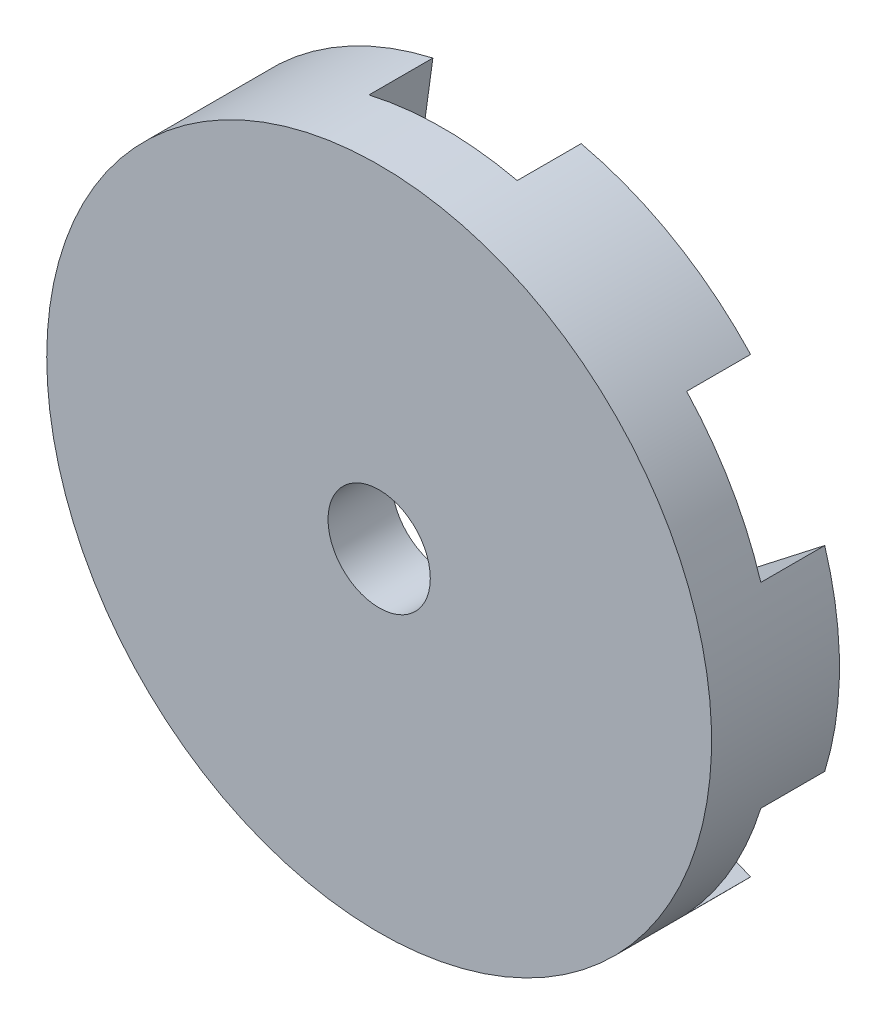
ISO-10303-21;
HEADER;
FILE_DESCRIPTION(('STEP AP214'),'2;1');
FILE_NAME('part.step','',(''),(''),'','','');
FILE_SCHEMA(('AUTOMOTIVE_DESIGN { 1 0 10303 214 1 1 1 1 }'));
ENDSEC;
DATA;
#1=APPLICATION_CONTEXT('core data for automotive mechanical design processes');
#2=APPLICATION_PROTOCOL_DEFINITION('international standard','automotive_design',2000,#1);
#3=PRODUCT_CONTEXT('',#1,'mechanical');
#4=PRODUCT('Part','Part','',(#3));
#5=PRODUCT_RELATED_PRODUCT_CATEGORY('part','',(#4));
#6=PRODUCT_DEFINITION_FORMATION('','',#4);
#7=PRODUCT_DEFINITION_CONTEXT('part definition',#1,'design');
#8=PRODUCT_DEFINITION('design','',#6,#7);
#9=PRODUCT_DEFINITION_SHAPE('','',#8);
#10=(LENGTH_UNIT() NAMED_UNIT(*) SI_UNIT(.MILLI.,.METRE.));
#11=(NAMED_UNIT(*) PLANE_ANGLE_UNIT() SI_UNIT($,.RADIAN.));
#12=(NAMED_UNIT(*) SI_UNIT($,.STERADIAN.) SOLID_ANGLE_UNIT());
#13=UNCERTAINTY_MEASURE_WITH_UNIT(LENGTH_MEASURE(1.E-05),#10,'distance_accuracy_value','');
#14=(GEOMETRIC_REPRESENTATION_CONTEXT(3) GLOBAL_UNCERTAINTY_ASSIGNED_CONTEXT((#13)) GLOBAL_UNIT_ASSIGNED_CONTEXT((#10,
#11,#12)) REPRESENTATION_CONTEXT('',''));
#15=CARTESIAN_POINT('',(0.,0.,0.));
#16=DIRECTION('',(0.,0.,1.));
#17=DIRECTION('',(1.,0.,0.));
#18=AXIS2_PLACEMENT_3D('',#15,#16,#17);
#19=CARTESIAN_POINT('',(0.,0.,0.));
#20=DIRECTION('',(0.,0.,1.));
#21=DIRECTION('',(1.,0.,0.));
#22=AXIS2_PLACEMENT_3D('',#19,#20,#21);
#23=CYLINDRICAL_SURFACE('',#22,2.);
#24=CARTESIAN_POINT('',(0.,0.,5.));
#25=DIRECTION('',(0.,0.,-1.));
#26=DIRECTION('',(-1.,0.,0.));
#27=AXIS2_PLACEMENT_3D('',#24,#25,#26);
#28=CIRCLE('',#27,2.);
#29=CARTESIAN_POINT('',(-2.,0.,5.));
#30=VERTEX_POINT('',#29);
#31=EDGE_CURVE('E253',#30,#30,#28,.F.);
#32=ORIENTED_EDGE('',*,*,#31,.T.);
#33=EDGE_LOOP('',(#32));
#34=FACE_BOUND('',#33,.T.);
#35=CARTESIAN_POINT('',(0.,0.,2.5));
#36=DIRECTION('',(0.,0.,1.));
#37=DIRECTION('',(1.,0.,0.));
#38=AXIS2_PLACEMENT_3D('',#35,#36,#37);
#39=CIRCLE('',#38,2.);
#40=CARTESIAN_POINT('',(2.,0.,2.5));
#41=VERTEX_POINT('',#40);
#42=EDGE_CURVE('E247',#41,#41,#39,.T.);
#43=ORIENTED_EDGE('',*,*,#42,.F.);
#44=EDGE_LOOP('',(#43));
#45=FACE_BOUND('',#44,.T.);
#46=ADVANCED_FACE('F32',(#34,#45),#23,.F.);
#47=CARTESIAN_POINT('',(0.,0.,5.));
#48=DIRECTION('',(0.,0.,-1.));
#49=DIRECTION('',(-1.,0.,0.));
#50=AXIS2_PLACEMENT_3D('',#47,#48,#49);
#51=CYLINDRICAL_SURFACE('',#50,13.);
#52=CARTESIAN_POINT('',(0.,0.,5.));
#53=DIRECTION('',(0.,0.,-1.));
#54=DIRECTION('',(-1.,0.,0.));
#55=AXIS2_PLACEMENT_3D('',#52,#53,#54);
#56=CIRCLE('',#55,13.);
#57=CARTESIAN_POINT('',(-13.,0.,5.));
#58=VERTEX_POINT('',#57);
#59=EDGE_CURVE('E325',#58,#58,#56,.T.);
#60=ORIENTED_EDGE('',*,*,#59,.T.);
#61=EDGE_LOOP('',(#60));
#62=FACE_BOUND('',#61,.T.);
#63=DIRECTION('',(0.,0.,-1.));
#64=VECTOR('',#63,1.);
#65=CARTESIAN_POINT('',(9.52526991334298,8.84699005752596,5.));
#66=LINE('',#65,#64);
#67=CARTESIAN_POINT('',(9.52526991334298,8.84699005752596,0.));
#68=VERTEX_POINT('',#67);
#69=CARTESIAN_POINT('',(9.52526991334298,8.84699005752596,2.5));
#70=VERTEX_POINT('',#69);
#71=EDGE_CURVE('E56',#68,#70,#66,.F.);
#72=ORIENTED_EDGE('',*,*,#71,.F.);
#73=CARTESIAN_POINT('',(0.,0.,0.));
#74=DIRECTION('',(0.,0.,1.));
#75=DIRECTION('',(1.,0.,0.));
#76=AXIS2_PLACEMENT_3D('',#73,#74,#75);
#77=CIRCLE('',#76,13.);
#78=CARTESIAN_POINT('',(2.89908318017435,12.6726207516216,0.));
#79=VERTEX_POINT('',#78);
#80=EDGE_CURVE('E212',#68,#79,#77,.T.);
#81=ORIENTED_EDGE('',*,*,#80,.T.);
#82=DIRECTION('',(0.,0.,-1.));
#83=VECTOR('',#82,1.);
#84=CARTESIAN_POINT('',(2.89908318017436,12.6726207516216,5.));
#85=LINE('',#84,#83);
#86=CARTESIAN_POINT('',(2.89908318017435,12.6726207516216,2.5));
#87=VERTEX_POINT('',#86);
#88=EDGE_CURVE('E205',#87,#79,#85,.T.);
#89=ORIENTED_EDGE('',*,*,#88,.F.);
#90=CARTESIAN_POINT('',(0.,0.,2.5));
#91=DIRECTION('',(0.,0.,1.));
#92=DIRECTION('',(1.,0.,0.));
#93=AXIS2_PLACEMENT_3D('',#90,#91,#92);
#94=CIRCLE('',#93,13.);
#95=CARTESIAN_POINT('',(-2.89908318017435,12.6726207516216,2.5));
#96=VERTEX_POINT('',#95);
#97=EDGE_CURVE('E41',#87,#96,#94,.T.);
#98=ORIENTED_EDGE('',*,*,#97,.T.);
#99=DIRECTION('',(0.,0.,-1.));
#100=VECTOR('',#99,1.);
#101=CARTESIAN_POINT('',(-2.89908318017436,12.6726207516216,5.));
#102=LINE('',#101,#100);
#103=CARTESIAN_POINT('',(-2.89908318017435,12.6726207516216,0.));
#104=VERTEX_POINT('',#103);
#105=EDGE_CURVE('E203',#104,#96,#102,.F.);
#106=ORIENTED_EDGE('',*,*,#105,.F.);
#107=CARTESIAN_POINT('',(-9.52526991334298,8.84699005752595,0.));
#108=VERTEX_POINT('',#107);
#109=EDGE_CURVE('E289',#104,#108,#77,.T.);
#110=ORIENTED_EDGE('',*,*,#109,.T.);
#111=DIRECTION('',(0.,0.,-1.));
#112=VECTOR('',#111,1.);
#113=CARTESIAN_POINT('',(-9.52526991334298,8.84699005752595,5.));
#114=LINE('',#113,#112);
#115=CARTESIAN_POINT('',(-9.52526991334298,8.84699005752595,2.5));
#116=VERTEX_POINT('',#115);
#117=EDGE_CURVE('E201',#116,#108,#114,.T.);
#118=ORIENTED_EDGE('',*,*,#117,.F.);
#119=CARTESIAN_POINT('',(-12.4243530935173,3.8256306940956,2.5));
#120=VERTEX_POINT('',#119);
#121=EDGE_CURVE('E233',#116,#120,#94,.T.);
#122=ORIENTED_EDGE('',*,*,#121,.T.);
#123=DIRECTION('',(0.,0.,-1.));
#124=VECTOR('',#123,1.);
#125=CARTESIAN_POINT('',(-12.4243530935173,3.8256306940956,5.));
#126=LINE('',#125,#124);
#127=CARTESIAN_POINT('',(-12.4243530935173,3.8256306940956,0.));
#128=VERTEX_POINT('',#127);
#129=EDGE_CURVE('E199',#128,#120,#126,.F.);
#130=ORIENTED_EDGE('',*,*,#129,.F.);
#131=CARTESIAN_POINT('',(-12.4243530935173,-3.82563069409565,0.));
#132=VERTEX_POINT('',#131);
#133=EDGE_CURVE('E288',#128,#132,#77,.T.);
#134=ORIENTED_EDGE('',*,*,#133,.T.);
#135=DIRECTION('',(0.,0.,-1.));
#136=VECTOR('',#135,1.);
#137=CARTESIAN_POINT('',(-12.4243530935173,-3.82563069409565,5.));
#138=LINE('',#137,#136);
#139=CARTESIAN_POINT('',(-12.4243530935173,-3.82563069409564,2.5));
#140=VERTEX_POINT('',#139);
#141=EDGE_CURVE('E197',#140,#132,#138,.T.);
#142=ORIENTED_EDGE('',*,*,#141,.F.);
#143=CARTESIAN_POINT('',(-9.52526991334295,-8.84699005752599,2.5));
#144=VERTEX_POINT('',#143);
#145=EDGE_CURVE('E229',#140,#144,#94,.T.);
#146=ORIENTED_EDGE('',*,*,#145,.T.);
#147=DIRECTION('',(0.,0.,-1.));
#148=VECTOR('',#147,1.);
#149=CARTESIAN_POINT('',(-9.52526991334295,-8.84699005752599,5.));
#150=LINE('',#149,#148);
#151=CARTESIAN_POINT('',(-9.52526991334295,-8.84699005752599,0.));
#152=VERTEX_POINT('',#151);
#153=EDGE_CURVE('E195',#152,#144,#150,.F.);
#154=ORIENTED_EDGE('',*,*,#153,.F.);
#155=CARTESIAN_POINT('',(-2.89908318017435,-12.6726207516216,0.));
#156=VERTEX_POINT('',#155);
#157=EDGE_CURVE('E290',#152,#156,#77,.T.);
#158=ORIENTED_EDGE('',*,*,#157,.T.);
#159=DIRECTION('',(0.,0.,-1.));
#160=VECTOR('',#159,1.);
#161=CARTESIAN_POINT('',(-2.89908318017435,-12.6726207516216,5.));
#162=LINE('',#161,#160);
#163=CARTESIAN_POINT('',(-2.89908318017435,-12.6726207516216,2.5));
#164=VERTEX_POINT('',#163);
#165=EDGE_CURVE('E193',#164,#156,#162,.T.);
#166=ORIENTED_EDGE('',*,*,#165,.F.);
#167=CARTESIAN_POINT('',(2.89908318017437,-12.6726207516216,2.5));
#168=VERTEX_POINT('',#167);
#169=EDGE_CURVE('E224',#164,#168,#94,.T.);
#170=ORIENTED_EDGE('',*,*,#169,.T.);
#171=DIRECTION('',(0.,0.,-1.));
#172=VECTOR('',#171,1.);
#173=CARTESIAN_POINT('',(2.89908318017437,-12.6726207516216,5.));
#174=LINE('',#173,#172);
#175=CARTESIAN_POINT('',(2.89908318017437,-12.6726207516216,0.));
#176=VERTEX_POINT('',#175);
#177=EDGE_CURVE('E191',#176,#168,#174,.F.);
#178=ORIENTED_EDGE('',*,*,#177,.F.);
#179=CARTESIAN_POINT('',(9.52526991334296,-8.84699005752598,0.));
#180=VERTEX_POINT('',#179);
#181=EDGE_CURVE('E211',#176,#180,#77,.T.);
#182=ORIENTED_EDGE('',*,*,#181,.T.);
#183=DIRECTION('',(0.,0.,-1.));
#184=VECTOR('',#183,1.);
#185=CARTESIAN_POINT('',(9.52526991334296,-8.84699005752598,5.));
#186=LINE('',#185,#184);
#187=CARTESIAN_POINT('',(9.52526991334296,-8.84699005752598,2.5));
#188=VERTEX_POINT('',#187);
#189=EDGE_CURVE('E189',#188,#180,#186,.T.);
#190=ORIENTED_EDGE('',*,*,#189,.F.);
#191=CARTESIAN_POINT('',(12.4243530935173,-3.82563069409563,2.5));
#192=VERTEX_POINT('',#191);
#193=EDGE_CURVE('E36',#188,#192,#94,.T.);
#194=ORIENTED_EDGE('',*,*,#193,.T.);
#195=DIRECTION('',(0.,0.,-1.));
#196=VECTOR('',#195,1.);
#197=CARTESIAN_POINT('',(12.4243530935173,-3.82563069409563,5.));
#198=LINE('',#197,#196);
#199=CARTESIAN_POINT('',(12.4243530935173,-3.82563069409563,0.));
#200=VERTEX_POINT('',#199);
#201=EDGE_CURVE('E182',#200,#192,#198,.F.);
#202=ORIENTED_EDGE('',*,*,#201,.F.);
#203=CARTESIAN_POINT('',(12.4243530935173,3.82563069409561,0.));
#204=VERTEX_POINT('',#203);
#205=EDGE_CURVE('E208',#200,#204,#77,.T.);
#206=ORIENTED_EDGE('',*,*,#205,.T.);
#207=DIRECTION('',(0.,0.,-1.));
#208=VECTOR('',#207,1.);
#209=CARTESIAN_POINT('',(12.4243530935173,3.82563069409561,5.));
#210=LINE('',#209,#208);
#211=CARTESIAN_POINT('',(12.4243530935173,3.82563069409561,2.5));
#212=VERTEX_POINT('',#211);
#213=EDGE_CURVE('E48',#212,#204,#210,.T.);
#214=ORIENTED_EDGE('',*,*,#213,.F.);
#215=EDGE_CURVE('E11',#212,#70,#94,.T.);
#216=ORIENTED_EDGE('',*,*,#215,.T.);
#217=EDGE_LOOP('',(#72,#81,#89,#98,#106,#110,#118,#122,#130,#134,#142,#146,#154,#158,#166,#170,
#178,#182,#190,#194,#202,#206,#214,#216));
#218=FACE_BOUND('',#217,.T.);
#219=ADVANCED_FACE('F34',(#62,#218),#51,.T.);
#220=CARTESIAN_POINT('',(0.,0.,0.));
#221=DIRECTION('',(0.,0.,1.));
#222=DIRECTION('',(1.,0.,0.));
#223=AXIS2_PLACEMENT_3D('',#220,#221,#222);
#224=PLANE('',#223);
#225=DIRECTION('',(0.926153324129743,0.37714721290688,0.));
#226=VECTOR('',#225,1.);
#227=CARTESIAN_POINT('',(-1.73534493632216,4.26145395295102,0.));
#228=LINE('',#227,#226);
#229=CARTESIAN_POINT('',(3.75,6.49519052838327,0.));
#230=VERTEX_POINT('',#229);
#231=EDGE_CURVE('E222',#230,#68,#228,.T.);
#232=ORIENTED_EDGE('',*,*,#231,.F.);
#233=DIRECTION('',(-0.136457594721015,0.990645912949201,0.));
#234=VECTOR('',#233,1.);
#235=CARTESIAN_POINT('',(3.75,6.49519052838327,0.));
#236=LINE('',#235,#234);
#237=EDGE_CURVE('E179',#230,#79,#236,.T.);
#238=ORIENTED_EDGE('',*,*,#237,.T.);
#239=ORIENTED_EDGE('',*,*,#80,.F.);
#240=EDGE_LOOP('',(#232,#238,#239));
#241=FACE_BOUND('',#240,.T.);
#242=ADVANCED_FACE('F245',(#241),#224,.F.);
#243=DIRECTION('',(0.136457594721015,0.990645912949201,0.));
#244=VECTOR('',#243,1.);
#245=CARTESIAN_POINT('',(-4.55819984847429,0.627874177291836,0.));
#246=LINE('',#245,#244);
#247=CARTESIAN_POINT('',(-3.75,6.49519052838327,0.));
#248=VERTEX_POINT('',#247);
#249=EDGE_CURVE('E221',#248,#104,#246,.T.);
#250=ORIENTED_EDGE('',*,*,#249,.F.);
#251=DIRECTION('',(-0.926153324129744,0.377147212906878,0.));
#252=VECTOR('',#251,1.);
#253=CARTESIAN_POINT('',(-3.75,6.49519052838327,0.));
#254=LINE('',#253,#252);
#255=EDGE_CURVE('E246',#248,#108,#254,.T.);
#256=ORIENTED_EDGE('',*,*,#255,.T.);
#257=ORIENTED_EDGE('',*,*,#109,.F.);
#258=EDGE_LOOP('',(#250,#256,#257));
#259=FACE_BOUND('',#258,.T.);
#260=ADVANCED_FACE('F386',(#259),#224,.F.);
#261=DIRECTION('',(-0.789695729408728,0.61349870004232,0.));
#262=VECTOR('',#261,1.);
#263=CARTESIAN_POINT('',(-2.82285491215214,-3.63357977565922,0.));
#264=LINE('',#263,#262);
#265=CARTESIAN_POINT('',(-7.5,0.,0.));
#266=VERTEX_POINT('',#265);
#267=EDGE_CURVE('E219',#266,#128,#264,.T.);
#268=ORIENTED_EDGE('',*,*,#267,.F.);
#269=DIRECTION('',(-0.789695729408727,-0.613498700042321,0.));
#270=VECTOR('',#269,1.);
#271=CARTESIAN_POINT('',(-7.5,0.,0.));
#272=LINE('',#271,#270);
#273=EDGE_CURVE('E250',#266,#132,#272,.T.);
#274=ORIENTED_EDGE('',*,*,#273,.T.);
#275=ORIENTED_EDGE('',*,*,#133,.F.);
#276=EDGE_LOOP('',(#268,#274,#275));
#277=FACE_BOUND('',#276,.T.);
#278=ADVANCED_FACE('F287',(#277),#224,.F.);
#279=DIRECTION('',(-0.926153324129743,-0.37714721290688,0.));
#280=VECTOR('',#279,1.);
#281=CARTESIAN_POINT('',(1.73534493632217,-4.26145395295105,0.));
#282=LINE('',#281,#280);
#283=CARTESIAN_POINT('',(-3.75,-6.49519052838331,0.));
#284=VERTEX_POINT('',#283);
#285=EDGE_CURVE('E217',#284,#152,#282,.T.);
#286=ORIENTED_EDGE('',*,*,#285,.F.);
#287=DIRECTION('',(0.136457594721016,-0.9906459129492,0.));
#288=VECTOR('',#287,1.);
#289=CARTESIAN_POINT('',(-3.75,-6.49519052838331,0.));
#290=LINE('',#289,#288);
#291=EDGE_CURVE('E261',#284,#156,#290,.T.);
#292=ORIENTED_EDGE('',*,*,#291,.T.);
#293=ORIENTED_EDGE('',*,*,#157,.F.);
#294=EDGE_LOOP('',(#286,#292,#293));
#295=FACE_BOUND('',#294,.T.);
#296=ADVANCED_FACE('F471',(#295),#224,.F.);
#297=DIRECTION('',(-0.136457594721015,-0.990645912949201,0.));
#298=VECTOR('',#297,1.);
#299=CARTESIAN_POINT('',(4.5581998484743,-0.627874177291836,0.));
#300=LINE('',#299,#298);
#301=CARTESIAN_POINT('',(3.75,-6.49519052838331,0.));
#302=VERTEX_POINT('',#301);
#303=EDGE_CURVE('E215',#302,#176,#300,.T.);
#304=ORIENTED_EDGE('',*,*,#303,.F.);
#305=DIRECTION('',(0.926153324129743,-0.377147212906879,0.));
#306=VECTOR('',#305,1.);
#307=CARTESIAN_POINT('',(3.75,-6.49519052838331,0.));
#308=LINE('',#307,#306);
#309=EDGE_CURVE('E264',#302,#180,#308,.T.);
#310=ORIENTED_EDGE('',*,*,#309,.T.);
#311=ORIENTED_EDGE('',*,*,#181,.F.);
#312=EDGE_LOOP('',(#304,#310,#311));
#313=FACE_BOUND('',#312,.T.);
#314=ADVANCED_FACE('F297',(#313),#224,.F.);
#315=DIRECTION('',(0.789695729408728,-0.613498700042321,0.));
#316=VECTOR('',#315,1.);
#317=CARTESIAN_POINT('',(2.82285491215212,3.63357977565919,0.));
#318=LINE('',#317,#316);
#319=CARTESIAN_POINT('',(7.5,0.,0.));
#320=VERTEX_POINT('',#319);
#321=EDGE_CURVE('E213',#320,#200,#318,.T.);
#322=ORIENTED_EDGE('',*,*,#321,.F.);
#323=DIRECTION('',(0.789695729408728,0.613498700042321,0.));
#324=VECTOR('',#323,1.);
#325=CARTESIAN_POINT('',(7.5,0.,0.));
#326=LINE('',#325,#324);
#327=EDGE_CURVE('E166',#320,#204,#326,.T.);
#328=ORIENTED_EDGE('',*,*,#327,.T.);
#329=ORIENTED_EDGE('',*,*,#205,.F.);
#330=EDGE_LOOP('',(#322,#328,#329));
#331=FACE_BOUND('',#330,.T.);
#332=ADVANCED_FACE('F343',(#331),#224,.F.);
#333=CARTESIAN_POINT('',(11.4315353299546,6.6,2.5));
#334=DIRECTION('',(0.,0.,1.));
#335=DIRECTION('',(1.,0.,0.));
#336=AXIS2_PLACEMENT_3D('',#333,#334,#335);
#337=PLANE('',#336);
#338=ORIENTED_EDGE('',*,*,#42,.T.);
#339=EDGE_LOOP('',(#338));
#340=FACE_BOUND('',#339,.T.);
#341=DIRECTION('',(0.789695729408728,0.613498700042321,0.));
#342=VECTOR('',#341,1.);
#343=CARTESIAN_POINT('',(7.5,0.,2.5));
#344=LINE('',#343,#342);
#345=CARTESIAN_POINT('',(7.5,0.,2.5));
#346=VERTEX_POINT('',#345);
#347=EDGE_CURVE('E256',#346,#212,#344,.T.);
#348=ORIENTED_EDGE('',*,*,#347,.F.);
#349=DIRECTION('',(-0.789695729408728,0.613498700042321,0.));
#350=VECTOR('',#349,1.);
#351=CARTESIAN_POINT('',(7.5,0.,2.5));
#352=LINE('',#351,#350);
#353=EDGE_CURVE('E306',#192,#346,#352,.T.);
#354=ORIENTED_EDGE('',*,*,#353,.F.);
#355=ORIENTED_EDGE('',*,*,#193,.F.);
#356=DIRECTION('',(0.926153324129743,-0.377147212906879,0.));
#357=VECTOR('',#356,1.);
#358=CARTESIAN_POINT('',(3.75,-6.49519052838331,2.5));
#359=LINE('',#358,#357);
#360=CARTESIAN_POINT('',(3.75,-6.49519052838331,2.5));
#361=VERTEX_POINT('',#360);
#362=EDGE_CURVE('E304',#361,#188,#359,.T.);
#363=ORIENTED_EDGE('',*,*,#362,.F.);
#364=DIRECTION('',(0.136457594721015,0.990645912949201,0.));
#365=VECTOR('',#364,1.);
#366=CARTESIAN_POINT('',(3.75,-6.49519052838331,2.5));
#367=LINE('',#366,#365);
#368=EDGE_CURVE('E307',#168,#361,#367,.T.);
#369=ORIENTED_EDGE('',*,*,#368,.F.);
#370=ORIENTED_EDGE('',*,*,#169,.F.);
#371=DIRECTION('',(0.136457594721016,-0.9906459129492,0.));
#372=VECTOR('',#371,1.);
#373=CARTESIAN_POINT('',(-3.75,-6.49519052838331,2.5));
#374=LINE('',#373,#372);
#375=CARTESIAN_POINT('',(-3.75,-6.49519052838331,2.5));
#376=VERTEX_POINT('',#375);
#377=EDGE_CURVE('E309',#376,#164,#374,.T.);
#378=ORIENTED_EDGE('',*,*,#377,.F.);
#379=DIRECTION('',(0.926153324129743,0.37714721290688,0.));
#380=VECTOR('',#379,1.);
#381=CARTESIAN_POINT('',(-3.75,-6.49519052838331,2.5));
#382=LINE('',#381,#380);
#383=EDGE_CURVE('E314',#144,#376,#382,.T.);
#384=ORIENTED_EDGE('',*,*,#383,.F.);
#385=ORIENTED_EDGE('',*,*,#145,.F.);
#386=DIRECTION('',(-0.789695729408727,-0.613498700042321,0.));
#387=VECTOR('',#386,1.);
#388=CARTESIAN_POINT('',(-7.5,0.,2.5));
#389=LINE('',#388,#387);
#390=CARTESIAN_POINT('',(-7.5,0.,2.5));
#391=VERTEX_POINT('',#390);
#392=EDGE_CURVE('E316',#391,#140,#389,.T.);
#393=ORIENTED_EDGE('',*,*,#392,.F.);
#394=DIRECTION('',(0.789695729408728,-0.61349870004232,0.));
#395=VECTOR('',#394,1.);
#396=CARTESIAN_POINT('',(-7.5,0.,2.5));
#397=LINE('',#396,#395);
#398=EDGE_CURVE('E279',#120,#391,#397,.T.);
#399=ORIENTED_EDGE('',*,*,#398,.F.);
#400=ORIENTED_EDGE('',*,*,#121,.F.);
#401=DIRECTION('',(-0.926153324129744,0.377147212906878,0.));
#402=VECTOR('',#401,1.);
#403=CARTESIAN_POINT('',(-3.75,6.49519052838327,2.5));
#404=LINE('',#403,#402);
#405=CARTESIAN_POINT('',(-3.75,6.49519052838327,2.5));
#406=VERTEX_POINT('',#405);
#407=EDGE_CURVE('E319',#406,#116,#404,.T.);
#408=ORIENTED_EDGE('',*,*,#407,.F.);
#409=DIRECTION('',(-0.136457594721015,-0.990645912949201,0.));
#410=VECTOR('',#409,1.);
#411=CARTESIAN_POINT('',(-3.75,6.49519052838327,2.5));
#412=LINE('',#411,#410);
#413=EDGE_CURVE('E175',#96,#406,#412,.T.);
#414=ORIENTED_EDGE('',*,*,#413,.F.);
#415=ORIENTED_EDGE('',*,*,#97,.F.);
#416=DIRECTION('',(-0.136457594721015,0.990645912949201,0.));
#417=VECTOR('',#416,1.);
#418=CARTESIAN_POINT('',(3.75,6.49519052838327,2.5));
#419=LINE('',#418,#417);
#420=CARTESIAN_POINT('',(3.75,6.49519052838327,2.5));
#421=VERTEX_POINT('',#420);
#422=EDGE_CURVE('E165',#421,#87,#419,.T.);
#423=ORIENTED_EDGE('',*,*,#422,.F.);
#424=DIRECTION('',(-0.926153324129743,-0.37714721290688,0.));
#425=VECTOR('',#424,1.);
#426=CARTESIAN_POINT('',(3.75,6.49519052838327,2.5));
#427=LINE('',#426,#425);
#428=EDGE_CURVE('E158',#70,#421,#427,.T.);
#429=ORIENTED_EDGE('',*,*,#428,.F.);
#430=ORIENTED_EDGE('',*,*,#215,.F.);
#431=EDGE_LOOP('',(#348,#354,#355,#363,#369,#370,#378,#384,#385,#393,#399,#400,#408,#414,#415,
#423,#429,#430));
#432=FACE_BOUND('',#431,.T.);
#433=ADVANCED_FACE('F170',(#340,#432),#337,.F.);
#434=CARTESIAN_POINT('',(3.75,6.49519052838327,2.5));
#435=DIRECTION('',(0.37714721290688,-0.926153324129743,0.));
#436=DIRECTION('',(0.926153324129743,0.37714721290688,0.));
#437=AXIS2_PLACEMENT_3D('',#434,#435,#436);
#438=PLANE('',#437);
#439=ORIENTED_EDGE('',*,*,#71,.T.);
#440=ORIENTED_EDGE('',*,*,#428,.T.);
#441=DIRECTION('',(0.,0.,-1.));
#442=VECTOR('',#441,1.);
#443=CARTESIAN_POINT('',(3.75,6.49519052838327,2.5));
#444=LINE('',#443,#442);
#445=EDGE_CURVE('E162',#421,#230,#444,.T.);
#446=ORIENTED_EDGE('',*,*,#445,.T.);
#447=ORIENTED_EDGE('',*,*,#231,.T.);
#448=EDGE_LOOP('',(#439,#440,#446,#447));
#449=FACE_BOUND('',#448,.T.);
#450=ADVANCED_FACE('F160',(#449),#438,.T.);
#451=CARTESIAN_POINT('',(3.75,6.49519052838327,2.5));
#452=DIRECTION('',(-0.990645912949201,-0.136457594721015,0.));
#453=DIRECTION('',(0.136457594721015,-0.990645912949201,0.));
#454=AXIS2_PLACEMENT_3D('',#451,#452,#453);
#455=PLANE('',#454);
#456=ORIENTED_EDGE('',*,*,#88,.T.);
#457=ORIENTED_EDGE('',*,*,#237,.F.);
#458=ORIENTED_EDGE('',*,*,#445,.F.);
#459=ORIENTED_EDGE('',*,*,#422,.T.);
#460=EDGE_LOOP('',(#456,#457,#458,#459));
#461=FACE_BOUND('',#460,.T.);
#462=ADVANCED_FACE('F177',(#461),#455,.T.);
#463=CARTESIAN_POINT('',(-3.75,6.49519052838327,2.5));
#464=DIRECTION('',(0.990645912949201,-0.136457594721015,0.));
#465=DIRECTION('',(0.136457594721015,0.990645912949201,0.));
#466=AXIS2_PLACEMENT_3D('',#463,#464,#465);
#467=PLANE('',#466);
#468=ORIENTED_EDGE('',*,*,#105,.T.);
#469=ORIENTED_EDGE('',*,*,#413,.T.);
#470=DIRECTION('',(0.,0.,-1.));
#471=VECTOR('',#470,1.);
#472=CARTESIAN_POINT('',(-3.75,6.49519052838327,2.5));
#473=LINE('',#472,#471);
#474=EDGE_CURVE('E180',#406,#248,#473,.T.);
#475=ORIENTED_EDGE('',*,*,#474,.T.);
#476=ORIENTED_EDGE('',*,*,#249,.T.);
#477=EDGE_LOOP('',(#468,#469,#475,#476));
#478=FACE_BOUND('',#477,.T.);
#479=ADVANCED_FACE('F379',(#478),#467,.T.);
#480=CARTESIAN_POINT('',(-3.75,6.49519052838327,2.5));
#481=DIRECTION('',(-0.377147212906878,-0.926153324129744,0.));
#482=DIRECTION('',(0.926153324129744,-0.377147212906878,0.));
#483=AXIS2_PLACEMENT_3D('',#480,#481,#482);
#484=PLANE('',#483);
#485=ORIENTED_EDGE('',*,*,#117,.T.);
#486=ORIENTED_EDGE('',*,*,#255,.F.);
#487=ORIENTED_EDGE('',*,*,#474,.F.);
#488=ORIENTED_EDGE('',*,*,#407,.T.);
#489=EDGE_LOOP('',(#485,#486,#487,#488));
#490=FACE_BOUND('',#489,.T.);
#491=ADVANCED_FACE('F376',(#490),#484,.T.);
#492=CARTESIAN_POINT('',(-7.5,0.,2.5));
#493=DIRECTION('',(0.61349870004232,0.789695729408728,0.));
#494=DIRECTION('',(-0.789695729408728,0.61349870004232,0.));
#495=AXIS2_PLACEMENT_3D('',#492,#493,#494);
#496=PLANE('',#495);
#497=ORIENTED_EDGE('',*,*,#129,.T.);
#498=ORIENTED_EDGE('',*,*,#398,.T.);
#499=DIRECTION('',(0.,0.,-1.));
#500=VECTOR('',#499,1.);
#501=CARTESIAN_POINT('',(-7.5,0.,2.5));
#502=LINE('',#501,#500);
#503=EDGE_CURVE('E184',#391,#266,#502,.T.);
#504=ORIENTED_EDGE('',*,*,#503,.T.);
#505=ORIENTED_EDGE('',*,*,#267,.T.);
#506=EDGE_LOOP('',(#497,#498,#504,#505));
#507=FACE_BOUND('',#506,.T.);
#508=ADVANCED_FACE('F276',(#507),#496,.T.);
#509=CARTESIAN_POINT('',(-7.5,0.,2.5));
#510=DIRECTION('',(0.613498700042321,-0.789695729408727,0.));
#511=DIRECTION('',(0.789695729408727,0.613498700042321,0.));
#512=AXIS2_PLACEMENT_3D('',#509,#510,#511);
#513=PLANE('',#512);
#514=ORIENTED_EDGE('',*,*,#141,.T.);
#515=ORIENTED_EDGE('',*,*,#273,.F.);
#516=ORIENTED_EDGE('',*,*,#503,.F.);
#517=ORIENTED_EDGE('',*,*,#392,.T.);
#518=EDGE_LOOP('',(#514,#515,#516,#517));
#519=FACE_BOUND('',#518,.T.);
#520=ADVANCED_FACE('F283',(#519),#513,.T.);
#521=CARTESIAN_POINT('',(-3.75,-6.49519052838331,2.5));
#522=DIRECTION('',(-0.37714721290688,0.926153324129743,0.));
#523=DIRECTION('',(-0.926153324129743,-0.37714721290688,0.));
#524=AXIS2_PLACEMENT_3D('',#521,#522,#523);
#525=PLANE('',#524);
#526=ORIENTED_EDGE('',*,*,#153,.T.);
#527=ORIENTED_EDGE('',*,*,#383,.T.);
#528=DIRECTION('',(0.,0.,-1.));
#529=VECTOR('',#528,1.);
#530=CARTESIAN_POINT('',(-3.75,-6.49519052838331,2.5));
#531=LINE('',#530,#529);
#532=EDGE_CURVE('E272',#376,#284,#531,.T.);
#533=ORIENTED_EDGE('',*,*,#532,.T.);
#534=ORIENTED_EDGE('',*,*,#285,.T.);
#535=EDGE_LOOP('',(#526,#527,#533,#534));
#536=FACE_BOUND('',#535,.T.);
#537=ADVANCED_FACE('F367',(#536),#525,.T.);
#538=CARTESIAN_POINT('',(-3.75,-6.49519052838331,2.5));
#539=DIRECTION('',(0.9906459129492,0.136457594721016,0.));
#540=DIRECTION('',(-0.136457594721016,0.990645912949201,0.));
#541=AXIS2_PLACEMENT_3D('',#538,#539,#540);
#542=PLANE('',#541);
#543=ORIENTED_EDGE('',*,*,#165,.T.);
#544=ORIENTED_EDGE('',*,*,#291,.F.);
#545=ORIENTED_EDGE('',*,*,#532,.F.);
#546=ORIENTED_EDGE('',*,*,#377,.T.);
#547=EDGE_LOOP('',(#543,#544,#545,#546));
#548=FACE_BOUND('',#547,.T.);
#549=ADVANCED_FACE('F363',(#548),#542,.T.);
#550=CARTESIAN_POINT('',(3.75,-6.49519052838331,2.5));
#551=DIRECTION('',(-0.990645912949201,0.136457594721015,0.));
#552=DIRECTION('',(-0.136457594721015,-0.990645912949201,0.));
#553=AXIS2_PLACEMENT_3D('',#550,#551,#552);
#554=PLANE('',#553);
#555=ORIENTED_EDGE('',*,*,#177,.T.);
#556=ORIENTED_EDGE('',*,*,#368,.T.);
#557=DIRECTION('',(0.,0.,-1.));
#558=VECTOR('',#557,1.);
#559=CARTESIAN_POINT('',(3.75,-6.49519052838331,2.5));
#560=LINE('',#559,#558);
#561=EDGE_CURVE('E270',#361,#302,#560,.T.);
#562=ORIENTED_EDGE('',*,*,#561,.T.);
#563=ORIENTED_EDGE('',*,*,#303,.T.);
#564=EDGE_LOOP('',(#555,#556,#562,#563));
#565=FACE_BOUND('',#564,.T.);
#566=ADVANCED_FACE('F360',(#565),#554,.T.);
#567=CARTESIAN_POINT('',(3.75,-6.49519052838331,2.5));
#568=DIRECTION('',(0.377147212906879,0.926153324129743,0.));
#569=DIRECTION('',(-0.926153324129743,0.377147212906879,0.));
#570=AXIS2_PLACEMENT_3D('',#567,#568,#569);
#571=PLANE('',#570);
#572=ORIENTED_EDGE('',*,*,#189,.T.);
#573=ORIENTED_EDGE('',*,*,#309,.F.);
#574=ORIENTED_EDGE('',*,*,#561,.F.);
#575=ORIENTED_EDGE('',*,*,#362,.T.);
#576=EDGE_LOOP('',(#572,#573,#574,#575));
#577=FACE_BOUND('',#576,.T.);
#578=ADVANCED_FACE('F301',(#577),#571,.T.);
#579=CARTESIAN_POINT('',(7.5,0.,2.5));
#580=DIRECTION('',(-0.613498700042321,-0.789695729408728,0.));
#581=DIRECTION('',(0.789695729408728,-0.613498700042321,0.));
#582=AXIS2_PLACEMENT_3D('',#579,#580,#581);
#583=PLANE('',#582);
#584=ORIENTED_EDGE('',*,*,#201,.T.);
#585=ORIENTED_EDGE('',*,*,#353,.T.);
#586=DIRECTION('',(0.,0.,-1.));
#587=VECTOR('',#586,1.);
#588=CARTESIAN_POINT('',(7.5,0.,2.5));
#589=LINE('',#588,#587);
#590=EDGE_CURVE('E268',#346,#320,#589,.T.);
#591=ORIENTED_EDGE('',*,*,#590,.T.);
#592=ORIENTED_EDGE('',*,*,#321,.T.);
#593=EDGE_LOOP('',(#584,#585,#591,#592));
#594=FACE_BOUND('',#593,.T.);
#595=ADVANCED_FACE('F354',(#594),#583,.T.);
#596=CARTESIAN_POINT('',(7.5,0.,2.5));
#597=DIRECTION('',(-0.613498700042321,0.789695729408728,0.));
#598=DIRECTION('',(-0.789695729408728,-0.613498700042321,0.));
#599=AXIS2_PLACEMENT_3D('',#596,#597,#598);
#600=PLANE('',#599);
#601=ORIENTED_EDGE('',*,*,#213,.T.);
#602=ORIENTED_EDGE('',*,*,#327,.F.);
#603=ORIENTED_EDGE('',*,*,#590,.F.);
#604=ORIENTED_EDGE('',*,*,#347,.T.);
#605=EDGE_LOOP('',(#601,#602,#603,#604));
#606=FACE_BOUND('',#605,.T.);
#607=ADVANCED_FACE('F333',(#606),#600,.T.);
#608=CARTESIAN_POINT('',(0.,0.,5.));
#609=DIRECTION('',(0.,0.,-1.));
#610=DIRECTION('',(-1.,0.,0.));
#611=AXIS2_PLACEMENT_3D('',#608,#609,#610);
#612=PLANE('',#611);
#613=ORIENTED_EDGE('',*,*,#59,.F.);
#614=EDGE_LOOP('',(#613));
#615=FACE_BOUND('',#614,.T.);
#616=ORIENTED_EDGE('',*,*,#31,.F.);
#617=EDGE_LOOP('',(#616));
#618=FACE_BOUND('',#617,.T.);
#619=ADVANCED_FACE('F330',(#615,#618),#612,.F.);
#620=CLOSED_SHELL('',(#46,#219,#242,#260,#278,#296,#314,#332,#433,#450,#462,#479,#491,#508,#520,
#537,#549,#566,#578,#595,#607,#619));
#621=MANIFOLD_SOLID_BREP('B2',#620);
#622=ADVANCED_BREP_SHAPE_REPRESENTATION('',(#18,#621),#14);
#623=SHAPE_DEFINITION_REPRESENTATION(#9,#622);
ENDSEC;
END-ISO-10303-21;
